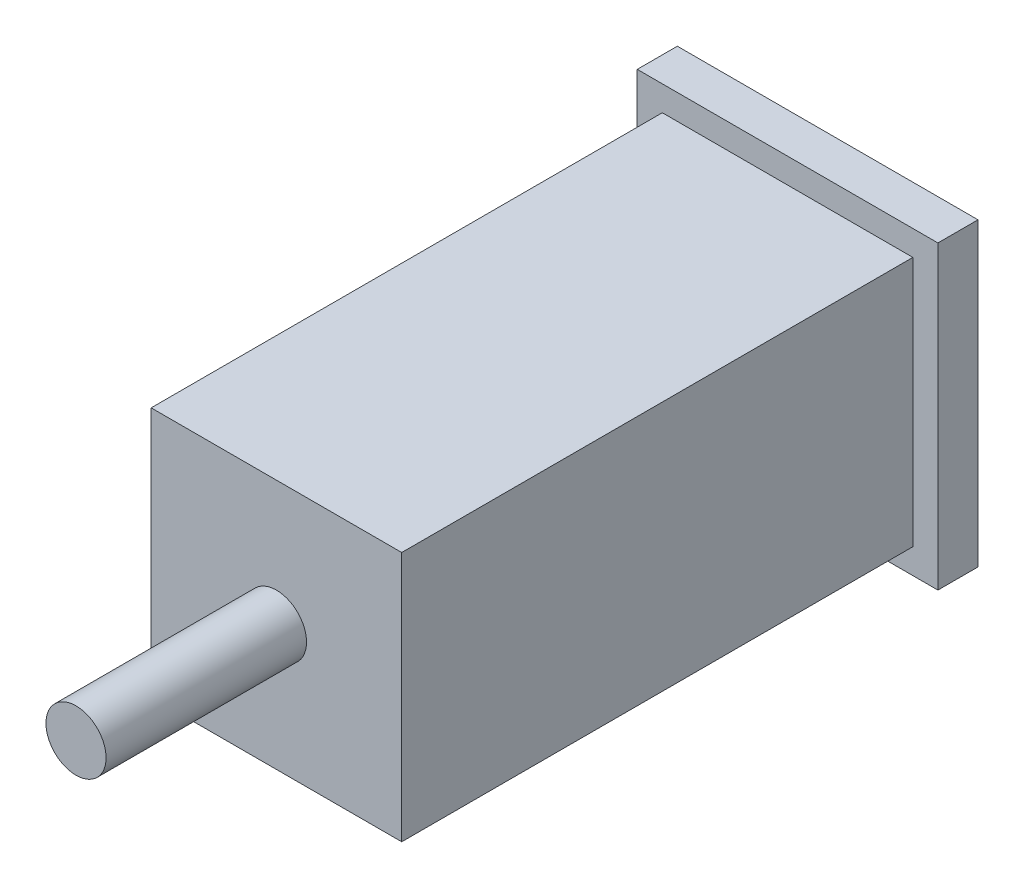
ISO-10303-21;
HEADER;
FILE_DESCRIPTION(('STEP AP214'),'2;1');
FILE_NAME('part.step','',(''),(''),'','','');
FILE_SCHEMA(('AUTOMOTIVE_DESIGN { 1 0 10303 214 1 1 1 1 }'));
ENDSEC;
DATA;
#1=APPLICATION_CONTEXT('core data for automotive mechanical design processes');
#2=APPLICATION_PROTOCOL_DEFINITION('international standard','automotive_design',2000,#1);
#3=PRODUCT_CONTEXT('',#1,'mechanical');
#4=PRODUCT('Part','Part','',(#3));
#5=PRODUCT_RELATED_PRODUCT_CATEGORY('part','',(#4));
#6=PRODUCT_DEFINITION_FORMATION('','',#4);
#7=PRODUCT_DEFINITION_CONTEXT('part definition',#1,'design');
#8=PRODUCT_DEFINITION('design','',#6,#7);
#9=PRODUCT_DEFINITION_SHAPE('','',#8);
#10=(LENGTH_UNIT() NAMED_UNIT(*) SI_UNIT(.MILLI.,.METRE.));
#11=(NAMED_UNIT(*) PLANE_ANGLE_UNIT() SI_UNIT($,.RADIAN.));
#12=(NAMED_UNIT(*) SI_UNIT($,.STERADIAN.) SOLID_ANGLE_UNIT());
#13=UNCERTAINTY_MEASURE_WITH_UNIT(LENGTH_MEASURE(1.E-05),#10,'distance_accuracy_value','');
#14=(GEOMETRIC_REPRESENTATION_CONTEXT(3) GLOBAL_UNCERTAINTY_ASSIGNED_CONTEXT((#13)) GLOBAL_UNIT_ASSIGNED_CONTEXT((#10,
#11,#12)) REPRESENTATION_CONTEXT('',''));
#15=CARTESIAN_POINT('',(0.,0.,0.));
#16=DIRECTION('',(0.,0.,1.));
#17=DIRECTION('',(1.,0.,0.));
#18=AXIS2_PLACEMENT_3D('',#15,#16,#17);
#19=CARTESIAN_POINT('',(0.,0.,4.));
#20=DIRECTION('',(0.,0.,-1.));
#21=DIRECTION('',(-1.,0.,0.));
#22=AXIS2_PLACEMENT_3D('',#19,#20,#21);
#23=PLANE('',#22);
#24=DIRECTION('',(0.,1.,0.));
#25=VECTOR('',#24,1.);
#26=CARTESIAN_POINT('',(15.,-15.,4.));
#27=LINE('',#26,#25);
#28=CARTESIAN_POINT('',(15.,-15.,4.));
#29=VERTEX_POINT('',#28);
#30=CARTESIAN_POINT('',(15.,15.,4.));
#31=VERTEX_POINT('',#30);
#32=EDGE_CURVE('E138',#29,#31,#27,.T.);
#33=ORIENTED_EDGE('',*,*,#32,.T.);
#34=DIRECTION('',(-1.,0.,0.));
#35=VECTOR('',#34,1.);
#36=CARTESIAN_POINT('',(-15.,15.,4.));
#37=LINE('',#36,#35);
#38=CARTESIAN_POINT('',(-15.,15.,4.));
#39=VERTEX_POINT('',#38);
#40=EDGE_CURVE('E142',#31,#39,#37,.T.);
#41=ORIENTED_EDGE('',*,*,#40,.T.);
#42=DIRECTION('',(0.,-1.,0.));
#43=VECTOR('',#42,1.);
#44=CARTESIAN_POINT('',(-15.,-15.,4.));
#45=LINE('',#44,#43);
#46=CARTESIAN_POINT('',(-15.,-15.,4.));
#47=VERTEX_POINT('',#46);
#48=EDGE_CURVE('E146',#39,#47,#45,.T.);
#49=ORIENTED_EDGE('',*,*,#48,.T.);
#50=DIRECTION('',(1.,0.,0.));
#51=VECTOR('',#50,1.);
#52=CARTESIAN_POINT('',(-15.,-15.,4.));
#53=LINE('',#52,#51);
#54=EDGE_CURVE('E149',#47,#29,#53,.T.);
#55=ORIENTED_EDGE('',*,*,#54,.T.);
#56=EDGE_LOOP('',(#33,#41,#49,#55));
#57=FACE_BOUND('',#56,.T.);
#58=DIRECTION('',(0.,1.,0.));
#59=VECTOR('',#58,1.);
#60=CARTESIAN_POINT('',(12.5,-12.5,4.));
#61=LINE('',#60,#59);
#62=CARTESIAN_POINT('',(12.5,-12.5,4.));
#63=VERTEX_POINT('',#62);
#64=CARTESIAN_POINT('',(12.5,12.5,4.));
#65=VERTEX_POINT('',#64);
#66=EDGE_CURVE('E54',#63,#65,#61,.T.);
#67=ORIENTED_EDGE('',*,*,#66,.F.);
#68=DIRECTION('',(1.,0.,0.));
#69=VECTOR('',#68,1.);
#70=CARTESIAN_POINT('',(-12.5,-12.5,4.));
#71=LINE('',#70,#69);
#72=CARTESIAN_POINT('',(-12.5,-12.5,4.));
#73=VERTEX_POINT('',#72);
#74=EDGE_CURVE('E58',#73,#63,#71,.T.);
#75=ORIENTED_EDGE('',*,*,#74,.F.);
#76=DIRECTION('',(0.,-1.,0.));
#77=VECTOR('',#76,1.);
#78=CARTESIAN_POINT('',(-12.5,-12.5,4.));
#79=LINE('',#78,#77);
#80=CARTESIAN_POINT('',(-12.5,12.5,4.));
#81=VERTEX_POINT('',#80);
#82=EDGE_CURVE('E318',#81,#73,#79,.T.);
#83=ORIENTED_EDGE('',*,*,#82,.F.);
#84=DIRECTION('',(-1.,0.,0.));
#85=VECTOR('',#84,1.);
#86=CARTESIAN_POINT('',(-12.5,12.5,4.));
#87=LINE('',#86,#85);
#88=EDGE_CURVE('E308',#65,#81,#87,.T.);
#89=ORIENTED_EDGE('',*,*,#88,.F.);
#90=EDGE_LOOP('',(#67,#75,#83,#89));
#91=FACE_BOUND('',#90,.T.);
#92=ADVANCED_FACE('F37',(#57,#91),#23,.F.);
#93=CARTESIAN_POINT('',(15.,-15.,4.));
#94=DIRECTION('',(-1.,0.,0.));
#95=DIRECTION('',(0.,0.,1.));
#96=AXIS2_PLACEMENT_3D('',#93,#94,#95);
#97=PLANE('',#96);
#98=DIRECTION('',(0.,1.,0.));
#99=VECTOR('',#98,1.);
#100=CARTESIAN_POINT('',(15.,-15.,0.));
#101=LINE('',#100,#99);
#102=CARTESIAN_POINT('',(15.,-15.,0.));
#103=VERTEX_POINT('',#102);
#104=CARTESIAN_POINT('',(15.,15.,0.));
#105=VERTEX_POINT('',#104);
#106=EDGE_CURVE('E127',#103,#105,#101,.T.);
#107=ORIENTED_EDGE('',*,*,#106,.T.);
#108=DIRECTION('',(0.,0.,-1.));
#109=VECTOR('',#108,1.);
#110=CARTESIAN_POINT('',(15.,15.,4.));
#111=LINE('',#110,#109);
#112=EDGE_CURVE('E41',#31,#105,#111,.T.);
#113=ORIENTED_EDGE('',*,*,#112,.F.);
#114=ORIENTED_EDGE('',*,*,#32,.F.);
#115=DIRECTION('',(0.,0.,-1.));
#116=VECTOR('',#115,1.);
#117=CARTESIAN_POINT('',(15.,-15.,4.));
#118=LINE('',#117,#116);
#119=EDGE_CURVE('E151',#29,#103,#118,.T.);
#120=ORIENTED_EDGE('',*,*,#119,.T.);
#121=EDGE_LOOP('',(#107,#113,#114,#120));
#122=FACE_BOUND('',#121,.T.);
#123=ADVANCED_FACE('F39',(#122),#97,.F.);
#124=CARTESIAN_POINT('',(-15.,15.,4.));
#125=DIRECTION('',(0.,-1.,0.));
#126=DIRECTION('',(0.,0.,-1.));
#127=AXIS2_PLACEMENT_3D('',#124,#125,#126);
#128=PLANE('',#127);
#129=DIRECTION('',(-1.,0.,0.));
#130=VECTOR('',#129,1.);
#131=CARTESIAN_POINT('',(-15.,15.,0.));
#132=LINE('',#131,#130);
#133=CARTESIAN_POINT('',(-15.,15.,0.));
#134=VERTEX_POINT('',#133);
#135=EDGE_CURVE('E132',#105,#134,#132,.T.);
#136=ORIENTED_EDGE('',*,*,#135,.T.);
#137=DIRECTION('',(0.,0.,-1.));
#138=VECTOR('',#137,1.);
#139=CARTESIAN_POINT('',(-15.,15.,4.));
#140=LINE('',#139,#138);
#141=EDGE_CURVE('E166',#39,#134,#140,.T.);
#142=ORIENTED_EDGE('',*,*,#141,.F.);
#143=ORIENTED_EDGE('',*,*,#40,.F.);
#144=ORIENTED_EDGE('',*,*,#112,.T.);
#145=EDGE_LOOP('',(#136,#142,#143,#144));
#146=FACE_BOUND('',#145,.T.);
#147=ADVANCED_FACE('F177',(#146),#128,.F.);
#148=CARTESIAN_POINT('',(-15.,-15.,4.));
#149=DIRECTION('',(1.,0.,0.));
#150=DIRECTION('',(0.,0.,-1.));
#151=AXIS2_PLACEMENT_3D('',#148,#149,#150);
#152=PLANE('',#151);
#153=DIRECTION('',(0.,-1.,0.));
#154=VECTOR('',#153,1.);
#155=CARTESIAN_POINT('',(-15.,-15.,0.));
#156=LINE('',#155,#154);
#157=CARTESIAN_POINT('',(-15.,-15.,0.));
#158=VERTEX_POINT('',#157);
#159=EDGE_CURVE('E155',#134,#158,#156,.T.);
#160=ORIENTED_EDGE('',*,*,#159,.T.);
#161=DIRECTION('',(0.,0.,-1.));
#162=VECTOR('',#161,1.);
#163=CARTESIAN_POINT('',(-15.,-15.,4.));
#164=LINE('',#163,#162);
#165=EDGE_CURVE('E163',#47,#158,#164,.T.);
#166=ORIENTED_EDGE('',*,*,#165,.F.);
#167=ORIENTED_EDGE('',*,*,#48,.F.);
#168=ORIENTED_EDGE('',*,*,#141,.T.);
#169=EDGE_LOOP('',(#160,#166,#167,#168));
#170=FACE_BOUND('',#169,.T.);
#171=ADVANCED_FACE('F186',(#170),#152,.F.);
#172=CARTESIAN_POINT('',(-15.,-15.,4.));
#173=DIRECTION('',(0.,1.,0.));
#174=DIRECTION('',(0.,0.,1.));
#175=AXIS2_PLACEMENT_3D('',#172,#173,#174);
#176=PLANE('',#175);
#177=DIRECTION('',(1.,0.,0.));
#178=VECTOR('',#177,1.);
#179=CARTESIAN_POINT('',(-15.,-15.,0.));
#180=LINE('',#179,#178);
#181=EDGE_CURVE('E143',#158,#103,#180,.T.);
#182=ORIENTED_EDGE('',*,*,#181,.T.);
#183=ORIENTED_EDGE('',*,*,#119,.F.);
#184=ORIENTED_EDGE('',*,*,#54,.F.);
#185=ORIENTED_EDGE('',*,*,#165,.T.);
#186=EDGE_LOOP('',(#182,#183,#184,#185));
#187=FACE_BOUND('',#186,.T.);
#188=ADVANCED_FACE('F189',(#187),#176,.F.);
#189=CARTESIAN_POINT('',(0.,0.,0.));
#190=DIRECTION('',(0.,0.,-1.));
#191=DIRECTION('',(-1.,0.,0.));
#192=AXIS2_PLACEMENT_3D('',#189,#190,#191);
#193=PLANE('',#192);
#194=ORIENTED_EDGE('',*,*,#106,.F.);
#195=ORIENTED_EDGE('',*,*,#181,.F.);
#196=ORIENTED_EDGE('',*,*,#159,.F.);
#197=ORIENTED_EDGE('',*,*,#135,.F.);
#198=EDGE_LOOP('',(#194,#195,#196,#197));
#199=FACE_BOUND('',#198,.T.);
#200=ADVANCED_FACE('F184',(#199),#193,.T.);
#201=CARTESIAN_POINT('',(12.5,-12.5,55.));
#202=DIRECTION('',(-1.,0.,0.));
#203=DIRECTION('',(0.,0.,1.));
#204=AXIS2_PLACEMENT_3D('',#201,#202,#203);
#205=PLANE('',#204);
#206=ORIENTED_EDGE('',*,*,#66,.T.);
#207=DIRECTION('',(0.,0.,-1.));
#208=VECTOR('',#207,1.);
#209=CARTESIAN_POINT('',(12.5,12.5,55.));
#210=LINE('',#209,#208);
#211=CARTESIAN_POINT('',(12.5,12.5,55.));
#212=VERTEX_POINT('',#211);
#213=EDGE_CURVE('E107',#212,#65,#210,.T.);
#214=ORIENTED_EDGE('',*,*,#213,.F.);
#215=DIRECTION('',(0.,1.,0.));
#216=VECTOR('',#215,1.);
#217=CARTESIAN_POINT('',(12.5,-12.5,55.));
#218=LINE('',#217,#216);
#219=CARTESIAN_POINT('',(12.5,-12.5,55.));
#220=VERTEX_POINT('',#219);
#221=EDGE_CURVE('E114',#220,#212,#218,.T.);
#222=ORIENTED_EDGE('',*,*,#221,.F.);
#223=DIRECTION('',(0.,0.,-1.));
#224=VECTOR('',#223,1.);
#225=CARTESIAN_POINT('',(12.5,-12.5,55.));
#226=LINE('',#225,#224);
#227=EDGE_CURVE('E314',#220,#63,#226,.T.);
#228=ORIENTED_EDGE('',*,*,#227,.T.);
#229=EDGE_LOOP('',(#206,#214,#222,#228));
#230=FACE_BOUND('',#229,.T.);
#231=ADVANCED_FACE('F125',(#230),#205,.F.);
#232=CARTESIAN_POINT('',(-12.5,12.5,55.));
#233=DIRECTION('',(0.,-1.,0.));
#234=DIRECTION('',(0.,0.,-1.));
#235=AXIS2_PLACEMENT_3D('',#232,#233,#234);
#236=PLANE('',#235);
#237=ORIENTED_EDGE('',*,*,#88,.T.);
#238=DIRECTION('',(0.,0.,-1.));
#239=VECTOR('',#238,1.);
#240=CARTESIAN_POINT('',(-12.5,12.5,55.));
#241=LINE('',#240,#239);
#242=CARTESIAN_POINT('',(-12.5,12.5,55.));
#243=VERTEX_POINT('',#242);
#244=EDGE_CURVE('E109',#243,#81,#241,.T.);
#245=ORIENTED_EDGE('',*,*,#244,.F.);
#246=DIRECTION('',(-1.,0.,0.));
#247=VECTOR('',#246,1.);
#248=CARTESIAN_POINT('',(-12.5,12.5,55.));
#249=LINE('',#248,#247);
#250=EDGE_CURVE('E102',#212,#243,#249,.T.);
#251=ORIENTED_EDGE('',*,*,#250,.F.);
#252=ORIENTED_EDGE('',*,*,#213,.T.);
#253=EDGE_LOOP('',(#237,#245,#251,#252));
#254=FACE_BOUND('',#253,.T.);
#255=ADVANCED_FACE('F105',(#254),#236,.F.);
#256=CARTESIAN_POINT('',(-12.5,-12.5,55.));
#257=DIRECTION('',(1.,0.,0.));
#258=DIRECTION('',(0.,0.,-1.));
#259=AXIS2_PLACEMENT_3D('',#256,#257,#258);
#260=PLANE('',#259);
#261=ORIENTED_EDGE('',*,*,#82,.T.);
#262=DIRECTION('',(0.,0.,-1.));
#263=VECTOR('',#262,1.);
#264=CARTESIAN_POINT('',(-12.5,-12.5,55.));
#265=LINE('',#264,#263);
#266=CARTESIAN_POINT('',(-12.5,-12.5,55.));
#267=VERTEX_POINT('',#266);
#268=EDGE_CURVE('E134',#267,#73,#265,.T.);
#269=ORIENTED_EDGE('',*,*,#268,.F.);
#270=DIRECTION('',(0.,-1.,0.));
#271=VECTOR('',#270,1.);
#272=CARTESIAN_POINT('',(-12.5,-12.5,55.));
#273=LINE('',#272,#271);
#274=EDGE_CURVE('E113',#243,#267,#273,.T.);
#275=ORIENTED_EDGE('',*,*,#274,.F.);
#276=ORIENTED_EDGE('',*,*,#244,.T.);
#277=EDGE_LOOP('',(#261,#269,#275,#276));
#278=FACE_BOUND('',#277,.T.);
#279=ADVANCED_FACE('F232',(#278),#260,.F.);
#280=CARTESIAN_POINT('',(-12.5,-12.5,55.));
#281=DIRECTION('',(0.,1.,0.));
#282=DIRECTION('',(0.,0.,1.));
#283=AXIS2_PLACEMENT_3D('',#280,#281,#282);
#284=PLANE('',#283);
#285=ORIENTED_EDGE('',*,*,#74,.T.);
#286=ORIENTED_EDGE('',*,*,#227,.F.);
#287=DIRECTION('',(1.,0.,0.));
#288=VECTOR('',#287,1.);
#289=CARTESIAN_POINT('',(-12.5,-12.5,55.));
#290=LINE('',#289,#288);
#291=EDGE_CURVE('E119',#267,#220,#290,.T.);
#292=ORIENTED_EDGE('',*,*,#291,.F.);
#293=ORIENTED_EDGE('',*,*,#268,.T.);
#294=EDGE_LOOP('',(#285,#286,#292,#293));
#295=FACE_BOUND('',#294,.T.);
#296=ADVANCED_FACE('F238',(#295),#284,.F.);
#297=CARTESIAN_POINT('',(0.,0.,55.));
#298=DIRECTION('',(0.,0.,-1.));
#299=DIRECTION('',(-1.,0.,0.));
#300=AXIS2_PLACEMENT_3D('',#297,#298,#299);
#301=PLANE('',#300);
#302=CARTESIAN_POINT('',(0.,0.,55.));
#303=DIRECTION('',(0.,0.,1.));
#304=DIRECTION('',(1.,0.,0.));
#305=AXIS2_PLACEMENT_3D('',#302,#303,#304);
#306=CIRCLE('',#305,3.);
#307=CARTESIAN_POINT('',(3.,0.,55.));
#308=VERTEX_POINT('',#307);
#309=EDGE_CURVE('E11',#308,#308,#306,.T.);
#310=ORIENTED_EDGE('',*,*,#309,.F.);
#311=EDGE_LOOP('',(#310));
#312=FACE_BOUND('',#311,.T.);
#313=ORIENTED_EDGE('',*,*,#221,.T.);
#314=ORIENTED_EDGE('',*,*,#250,.T.);
#315=ORIENTED_EDGE('',*,*,#274,.T.);
#316=ORIENTED_EDGE('',*,*,#291,.T.);
#317=EDGE_LOOP('',(#313,#314,#315,#316));
#318=FACE_BOUND('',#317,.T.);
#319=ADVANCED_FACE('F117',(#312,#318),#301,.F.);
#320=CARTESIAN_POINT('',(0.,0.,75.));
#321=DIRECTION('',(0.,0.,-1.));
#322=DIRECTION('',(-1.,0.,0.));
#323=AXIS2_PLACEMENT_3D('',#320,#321,#322);
#324=CYLINDRICAL_SURFACE('',#323,3.);
#325=CARTESIAN_POINT('',(0.,0.,75.));
#326=DIRECTION('',(0.,0.,1.));
#327=DIRECTION('',(1.,0.,0.));
#328=AXIS2_PLACEMENT_3D('',#325,#326,#327);
#329=CIRCLE('',#328,3.);
#330=CARTESIAN_POINT('',(3.,0.,75.));
#331=VERTEX_POINT('',#330);
#332=EDGE_CURVE('E304',#331,#331,#329,.T.);
#333=ORIENTED_EDGE('',*,*,#332,.F.);
#334=EDGE_LOOP('',(#333));
#335=FACE_BOUND('',#334,.T.);
#336=ORIENTED_EDGE('',*,*,#309,.T.);
#337=EDGE_LOOP('',(#336));
#338=FACE_BOUND('',#337,.T.);
#339=ADVANCED_FACE('F253',(#335,#338),#324,.T.);
#340=CARTESIAN_POINT('',(0.,0.,75.));
#341=DIRECTION('',(0.,0.,1.));
#342=DIRECTION('',(1.,0.,0.));
#343=AXIS2_PLACEMENT_3D('',#340,#341,#342);
#344=PLANE('',#343);
#345=ORIENTED_EDGE('',*,*,#332,.T.);
#346=EDGE_LOOP('',(#345));
#347=FACE_BOUND('',#346,.T.);
#348=ADVANCED_FACE('F261',(#347),#344,.T.);
#349=CLOSED_SHELL('',(#92,#123,#147,#171,#188,#200,#231,#255,#279,#296,#319,#339,#348));
#350=MANIFOLD_SOLID_BREP('B2',#349);
#351=ADVANCED_BREP_SHAPE_REPRESENTATION('',(#18,#350),#14);
#352=SHAPE_DEFINITION_REPRESENTATION(#9,#351);
ENDSEC;
END-ISO-10303-21;
